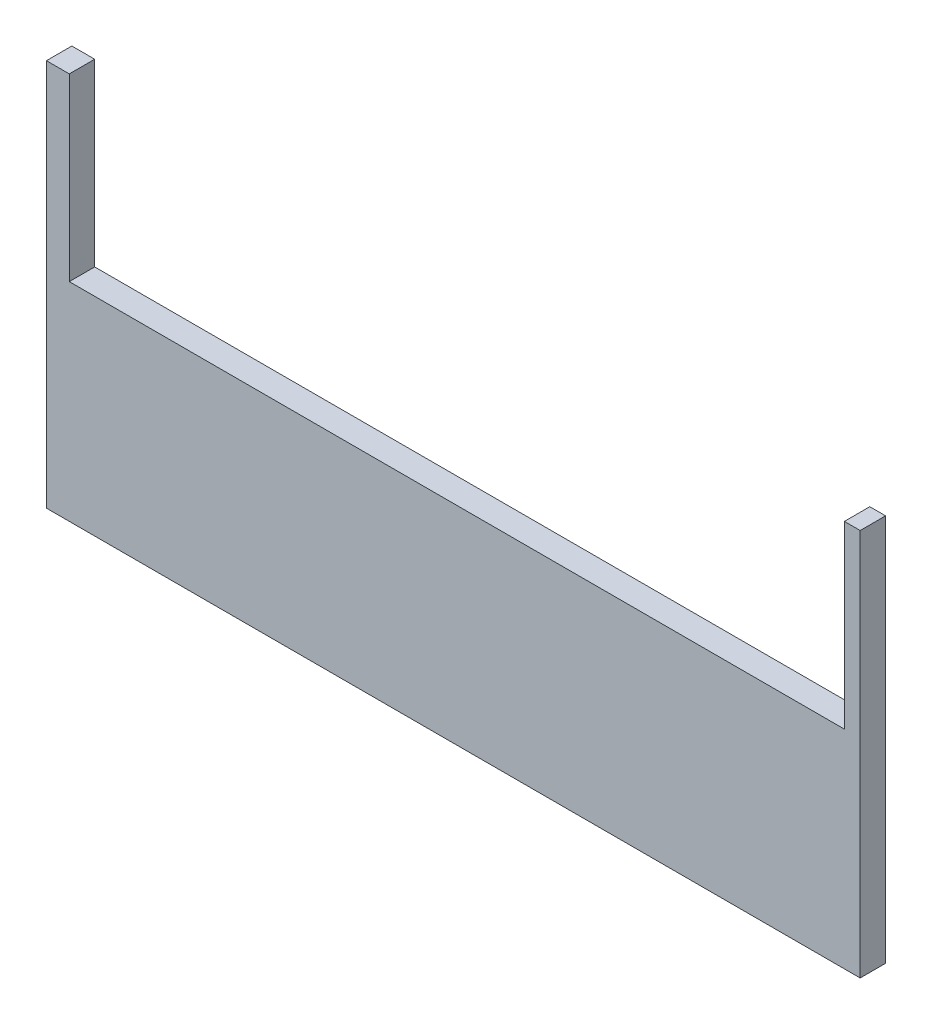
ISO-10303-21;
HEADER;
FILE_DESCRIPTION(('STEP AP214'),'2;1');
FILE_NAME('part.step','',(''),(''),'','','');
FILE_SCHEMA(('AUTOMOTIVE_DESIGN { 1 0 10303 214 1 1 1 1 }'));
ENDSEC;
DATA;
#1=APPLICATION_CONTEXT('core data for automotive mechanical design processes');
#2=APPLICATION_PROTOCOL_DEFINITION('international standard','automotive_design',2000,#1);
#3=PRODUCT_CONTEXT('',#1,'mechanical');
#4=PRODUCT('Part','Part','',(#3));
#5=PRODUCT_RELATED_PRODUCT_CATEGORY('part','',(#4));
#6=PRODUCT_DEFINITION_FORMATION('','',#4);
#7=PRODUCT_DEFINITION_CONTEXT('part definition',#1,'design');
#8=PRODUCT_DEFINITION('design','',#6,#7);
#9=PRODUCT_DEFINITION_SHAPE('','',#8);
#10=(LENGTH_UNIT() NAMED_UNIT(*) SI_UNIT(.MILLI.,.METRE.));
#11=(NAMED_UNIT(*) PLANE_ANGLE_UNIT() SI_UNIT($,.RADIAN.));
#12=(NAMED_UNIT(*) SI_UNIT($,.STERADIAN.) SOLID_ANGLE_UNIT());
#13=UNCERTAINTY_MEASURE_WITH_UNIT(LENGTH_MEASURE(1.E-05),#10,'distance_accuracy_value','');
#14=(GEOMETRIC_REPRESENTATION_CONTEXT(3) GLOBAL_UNCERTAINTY_ASSIGNED_CONTEXT((#13)) GLOBAL_UNIT_ASSIGNED_CONTEXT((#10,
#11,#12)) REPRESENTATION_CONTEXT('',''));
#15=CARTESIAN_POINT('',(0.,0.,0.));
#16=DIRECTION('',(0.,0.,1.));
#17=DIRECTION('',(1.,0.,0.));
#18=AXIS2_PLACEMENT_3D('',#15,#16,#17);
#19=CARTESIAN_POINT('',(0.,152.4,10.));
#20=DIRECTION('',(0.,-1.,0.));
#21=DIRECTION('',(0.,0.,-1.));
#22=AXIS2_PLACEMENT_3D('',#19,#20,#21);
#23=PLANE('',#22);
#24=DIRECTION('',(-1.,0.,0.));
#25=VECTOR('',#24,1.);
#26=CARTESIAN_POINT('',(0.,152.4,0.));
#27=LINE('',#26,#25);
#28=CARTESIAN_POINT('',(320.,152.4,0.));
#29=VERTEX_POINT('',#28);
#30=CARTESIAN_POINT('',(313.789929353407,152.4,0.));
#31=VERTEX_POINT('',#30);
#32=EDGE_CURVE('E145',#29,#31,#27,.T.);
#33=ORIENTED_EDGE('',*,*,#32,.T.);
#34=DIRECTION('',(0.,0.,1.));
#35=VECTOR('',#34,1.);
#36=CARTESIAN_POINT('',(313.789929353407,152.4,10.));
#37=LINE('',#36,#35);
#38=CARTESIAN_POINT('',(313.789929353407,152.4,10.));
#39=VERTEX_POINT('',#38);
#40=EDGE_CURVE('E125',#31,#39,#37,.T.);
#41=ORIENTED_EDGE('',*,*,#40,.T.);
#42=DIRECTION('',(-1.,0.,0.));
#43=VECTOR('',#42,1.);
#44=CARTESIAN_POINT('',(0.,152.4,10.));
#45=LINE('',#44,#43);
#46=CARTESIAN_POINT('',(320.,152.4,10.));
#47=VERTEX_POINT('',#46);
#48=EDGE_CURVE('E149',#47,#39,#45,.T.);
#49=ORIENTED_EDGE('',*,*,#48,.F.);
#50=DIRECTION('',(0.,0.,-1.));
#51=VECTOR('',#50,1.);
#52=CARTESIAN_POINT('',(320.,152.4,10.));
#53=LINE('',#52,#51);
#54=EDGE_CURVE('E161',#47,#29,#53,.T.);
#55=ORIENTED_EDGE('',*,*,#54,.T.);
#56=EDGE_LOOP('',(#33,#41,#49,#55));
#57=FACE_BOUND('',#56,.T.);
#58=ADVANCED_FACE('F37',(#57),#23,.F.);
#59=CARTESIAN_POINT('',(0.,0.,10.));
#60=DIRECTION('',(1.,0.,0.));
#61=DIRECTION('',(0.,0.,-1.));
#62=AXIS2_PLACEMENT_3D('',#59,#60,#61);
#63=PLANE('',#62);
#64=DIRECTION('',(0.,-1.,0.));
#65=VECTOR('',#64,1.);
#66=CARTESIAN_POINT('',(0.,0.,0.));
#67=LINE('',#66,#65);
#68=CARTESIAN_POINT('',(0.,152.4,0.));
#69=VERTEX_POINT('',#68);
#70=CARTESIAN_POINT('',(0.,0.,0.));
#71=VERTEX_POINT('',#70);
#72=EDGE_CURVE('E142',#69,#71,#67,.T.);
#73=ORIENTED_EDGE('',*,*,#72,.T.);
#74=DIRECTION('',(0.,0.,-1.));
#75=VECTOR('',#74,1.);
#76=CARTESIAN_POINT('',(0.,0.,10.));
#77=LINE('',#76,#75);
#78=CARTESIAN_POINT('',(0.,0.,10.));
#79=VERTEX_POINT('',#78);
#80=EDGE_CURVE('E45',#79,#71,#77,.T.);
#81=ORIENTED_EDGE('',*,*,#80,.F.);
#82=DIRECTION('',(0.,-1.,0.));
#83=VECTOR('',#82,1.);
#84=CARTESIAN_POINT('',(0.,0.,10.));
#85=LINE('',#84,#83);
#86=CARTESIAN_POINT('',(0.,152.4,10.));
#87=VERTEX_POINT('',#86);
#88=EDGE_CURVE('E143',#87,#79,#85,.T.);
#89=ORIENTED_EDGE('',*,*,#88,.F.);
#90=DIRECTION('',(0.,0.,-1.));
#91=VECTOR('',#90,1.);
#92=CARTESIAN_POINT('',(0.,152.4,10.));
#93=LINE('',#92,#91);
#94=EDGE_CURVE('E152',#87,#69,#93,.T.);
#95=ORIENTED_EDGE('',*,*,#94,.T.);
#96=EDGE_LOOP('',(#73,#81,#89,#95));
#97=FACE_BOUND('',#96,.T.);
#98=ADVANCED_FACE('F39',(#97),#63,.F.);
#99=CARTESIAN_POINT('',(0.,0.,10.));
#100=DIRECTION('',(0.,1.,0.));
#101=DIRECTION('',(0.,0.,1.));
#102=AXIS2_PLACEMENT_3D('',#99,#100,#101);
#103=PLANE('',#102);
#104=DIRECTION('',(1.,0.,0.));
#105=VECTOR('',#104,1.);
#106=CARTESIAN_POINT('',(0.,0.,0.));
#107=LINE('',#106,#105);
#108=CARTESIAN_POINT('',(320.,0.,0.));
#109=VERTEX_POINT('',#108);
#110=EDGE_CURVE('E155',#71,#109,#107,.T.);
#111=ORIENTED_EDGE('',*,*,#110,.T.);
#112=DIRECTION('',(0.,0.,-1.));
#113=VECTOR('',#112,1.);
#114=CARTESIAN_POINT('',(320.,0.,10.));
#115=LINE('',#114,#113);
#116=CARTESIAN_POINT('',(320.,0.,10.));
#117=VERTEX_POINT('',#116);
#118=EDGE_CURVE('E164',#117,#109,#115,.T.);
#119=ORIENTED_EDGE('',*,*,#118,.F.);
#120=DIRECTION('',(1.,0.,0.));
#121=VECTOR('',#120,1.);
#122=CARTESIAN_POINT('',(0.,0.,10.));
#123=LINE('',#122,#121);
#124=EDGE_CURVE('E91',#79,#117,#123,.T.);
#125=ORIENTED_EDGE('',*,*,#124,.F.);
#126=ORIENTED_EDGE('',*,*,#80,.T.);
#127=EDGE_LOOP('',(#111,#119,#125,#126));
#128=FACE_BOUND('',#127,.T.);
#129=ADVANCED_FACE('F167',(#128),#103,.F.);
#130=CARTESIAN_POINT('',(320.,0.,10.));
#131=DIRECTION('',(-1.,0.,0.));
#132=DIRECTION('',(0.,-1.,0.));
#133=AXIS2_PLACEMENT_3D('',#130,#131,#132);
#134=PLANE('',#133);
#135=DIRECTION('',(0.,1.,0.));
#136=VECTOR('',#135,1.);
#137=CARTESIAN_POINT('',(320.,0.,0.));
#138=LINE('',#137,#136);
#139=EDGE_CURVE('E157',#109,#29,#138,.T.);
#140=ORIENTED_EDGE('',*,*,#139,.T.);
#141=ORIENTED_EDGE('',*,*,#54,.F.);
#142=DIRECTION('',(0.,1.,0.));
#143=VECTOR('',#142,1.);
#144=CARTESIAN_POINT('',(320.,0.,10.));
#145=LINE('',#144,#143);
#146=EDGE_CURVE('E147',#117,#47,#145,.T.);
#147=ORIENTED_EDGE('',*,*,#146,.F.);
#148=ORIENTED_EDGE('',*,*,#118,.T.);
#149=EDGE_LOOP('',(#140,#141,#147,#148));
#150=FACE_BOUND('',#149,.T.);
#151=ADVANCED_FACE('F174',(#150),#134,.F.);
#152=CARTESIAN_POINT('',(8.98992935340653,152.4,10.));
#153=VERTEX_POINT('',#152);
#154=EDGE_CURVE('E61',#153,#87,#45,.T.);
#155=ORIENTED_EDGE('',*,*,#154,.F.);
#156=DIRECTION('',(0.,0.,-1.));
#157=VECTOR('',#156,1.);
#158=CARTESIAN_POINT('',(8.98992935340653,152.4,10.));
#159=LINE('',#158,#157);
#160=CARTESIAN_POINT('',(8.98992935340653,152.4,0.));
#161=VERTEX_POINT('',#160);
#162=EDGE_CURVE('E136',#153,#161,#159,.T.);
#163=ORIENTED_EDGE('',*,*,#162,.T.);
#164=EDGE_CURVE('E83',#161,#69,#27,.T.);
#165=ORIENTED_EDGE('',*,*,#164,.T.);
#166=ORIENTED_EDGE('',*,*,#94,.F.);
#167=EDGE_LOOP('',(#155,#163,#165,#166));
#168=FACE_BOUND('',#167,.T.);
#169=ADVANCED_FACE('F180',(#168),#23,.F.);
#170=CARTESIAN_POINT('',(0.,0.,10.));
#171=DIRECTION('',(0.,0.,-1.));
#172=DIRECTION('',(-1.,0.,0.));
#173=AXIS2_PLACEMENT_3D('',#170,#171,#172);
#174=PLANE('',#173);
#175=ORIENTED_EDGE('',*,*,#48,.T.);
#176=DIRECTION('',(0.,-1.,0.));
#177=VECTOR('',#176,1.);
#178=CARTESIAN_POINT('',(313.789929353406,-4.62162476834946E-13,10.));
#179=LINE('',#178,#177);
#180=CARTESIAN_POINT('',(313.789929353406,81.6542341938485,10.));
#181=VERTEX_POINT('',#180);
#182=EDGE_CURVE('E139',#39,#181,#179,.T.);
#183=ORIENTED_EDGE('',*,*,#182,.T.);
#184=DIRECTION('',(-1.,0.,0.));
#185=VECTOR('',#184,1.);
#186=CARTESIAN_POINT('',(0.,81.6542341938484,10.));
#187=LINE('',#186,#185);
#188=CARTESIAN_POINT('',(8.98992935340653,81.6542341938484,10.));
#189=VERTEX_POINT('',#188);
#190=EDGE_CURVE('E115',#181,#189,#187,.T.);
#191=ORIENTED_EDGE('',*,*,#190,.T.);
#192=DIRECTION('',(0.,1.,0.));
#193=VECTOR('',#192,1.);
#194=CARTESIAN_POINT('',(8.98992935340653,0.,10.));
#195=LINE('',#194,#193);
#196=EDGE_CURVE('E118',#189,#153,#195,.T.);
#197=ORIENTED_EDGE('',*,*,#196,.T.);
#198=ORIENTED_EDGE('',*,*,#154,.T.);
#199=ORIENTED_EDGE('',*,*,#88,.T.);
#200=ORIENTED_EDGE('',*,*,#124,.T.);
#201=ORIENTED_EDGE('',*,*,#146,.T.);
#202=EDGE_LOOP('',(#175,#183,#191,#197,#198,#199,#200,#201));
#203=FACE_BOUND('',#202,.T.);
#204=ADVANCED_FACE('F178',(#203),#174,.F.);
#205=CARTESIAN_POINT('',(0.,0.,0.));
#206=DIRECTION('',(0.,0.,-1.));
#207=DIRECTION('',(-1.,0.,0.));
#208=AXIS2_PLACEMENT_3D('',#205,#206,#207);
#209=PLANE('',#208);
#210=DIRECTION('',(0.,1.,0.));
#211=VECTOR('',#210,1.);
#212=CARTESIAN_POINT('',(313.789929353406,81.6542341938485,0.));
#213=LINE('',#212,#211);
#214=CARTESIAN_POINT('',(313.789929353406,81.6542341938485,0.));
#215=VERTEX_POINT('',#214);
#216=EDGE_CURVE('E122',#215,#31,#213,.T.);
#217=ORIENTED_EDGE('',*,*,#216,.T.);
#218=ORIENTED_EDGE('',*,*,#32,.F.);
#219=ORIENTED_EDGE('',*,*,#139,.F.);
#220=ORIENTED_EDGE('',*,*,#110,.F.);
#221=ORIENTED_EDGE('',*,*,#72,.F.);
#222=ORIENTED_EDGE('',*,*,#164,.F.);
#223=DIRECTION('',(0.,1.,0.));
#224=VECTOR('',#223,1.);
#225=CARTESIAN_POINT('',(8.98992935340653,0.,0.));
#226=LINE('',#225,#224);
#227=CARTESIAN_POINT('',(8.98992935340653,81.6542341938484,0.));
#228=VERTEX_POINT('',#227);
#229=EDGE_CURVE('E11',#228,#161,#226,.T.);
#230=ORIENTED_EDGE('',*,*,#229,.F.);
#231=DIRECTION('',(1.,0.,0.));
#232=VECTOR('',#231,1.);
#233=CARTESIAN_POINT('',(313.789929353406,81.6542341938485,0.));
#234=LINE('',#233,#232);
#235=EDGE_CURVE('E52',#228,#215,#234,.T.);
#236=ORIENTED_EDGE('',*,*,#235,.T.);
#237=EDGE_LOOP('',(#217,#218,#219,#220,#221,#222,#230,#236));
#238=FACE_BOUND('',#237,.T.);
#239=ADVANCED_FACE('F131',(#238),#209,.T.);
#240=CARTESIAN_POINT('',(313.789929353406,81.6542341938485,0.));
#241=DIRECTION('',(1.,0.,0.));
#242=DIRECTION('',(0.,1.,0.));
#243=AXIS2_PLACEMENT_3D('',#240,#241,#242);
#244=PLANE('',#243);
#245=ORIENTED_EDGE('',*,*,#216,.F.);
#246=DIRECTION('',(0.,0.,1.));
#247=VECTOR('',#246,1.);
#248=CARTESIAN_POINT('',(313.789929353406,81.6542341938485,0.));
#249=LINE('',#248,#247);
#250=EDGE_CURVE('E111',#215,#181,#249,.T.);
#251=ORIENTED_EDGE('',*,*,#250,.T.);
#252=ORIENTED_EDGE('',*,*,#182,.F.);
#253=ORIENTED_EDGE('',*,*,#40,.F.);
#254=EDGE_LOOP('',(#245,#251,#252,#253));
#255=FACE_BOUND('',#254,.T.);
#256=ADVANCED_FACE('F123',(#255),#244,.F.);
#257=CARTESIAN_POINT('',(313.789929353406,81.6542341938485,0.));
#258=DIRECTION('',(0.,-1.,0.));
#259=DIRECTION('',(1.,0.,0.));
#260=AXIS2_PLACEMENT_3D('',#257,#258,#259);
#261=PLANE('',#260);
#262=ORIENTED_EDGE('',*,*,#250,.F.);
#263=ORIENTED_EDGE('',*,*,#235,.F.);
#264=DIRECTION('',(0.,0.,1.));
#265=VECTOR('',#264,1.);
#266=CARTESIAN_POINT('',(8.98992935340653,81.6542341938484,0.));
#267=LINE('',#266,#265);
#268=EDGE_CURVE('E119',#228,#189,#267,.T.);
#269=ORIENTED_EDGE('',*,*,#268,.T.);
#270=ORIENTED_EDGE('',*,*,#190,.F.);
#271=EDGE_LOOP('',(#262,#263,#269,#270));
#272=FACE_BOUND('',#271,.T.);
#273=ADVANCED_FACE('F113',(#272),#261,.F.);
#274=CARTESIAN_POINT('',(8.98992935340653,81.6542341938484,0.));
#275=DIRECTION('',(-1.,0.,0.));
#276=DIRECTION('',(0.,0.,1.));
#277=AXIS2_PLACEMENT_3D('',#274,#275,#276);
#278=PLANE('',#277);
#279=ORIENTED_EDGE('',*,*,#196,.F.);
#280=ORIENTED_EDGE('',*,*,#268,.F.);
#281=ORIENTED_EDGE('',*,*,#229,.T.);
#282=ORIENTED_EDGE('',*,*,#162,.F.);
#283=EDGE_LOOP('',(#279,#280,#281,#282));
#284=FACE_BOUND('',#283,.T.);
#285=ADVANCED_FACE('F181',(#284),#278,.F.);
#286=CLOSED_SHELL('',(#58,#98,#129,#151,#169,#204,#239,#256,#273,#285));
#287=MANIFOLD_SOLID_BREP('B2',#286);
#288=ADVANCED_BREP_SHAPE_REPRESENTATION('',(#18,#287),#14);
#289=SHAPE_DEFINITION_REPRESENTATION(#9,#288);
ENDSEC;
END-ISO-10303-21;
